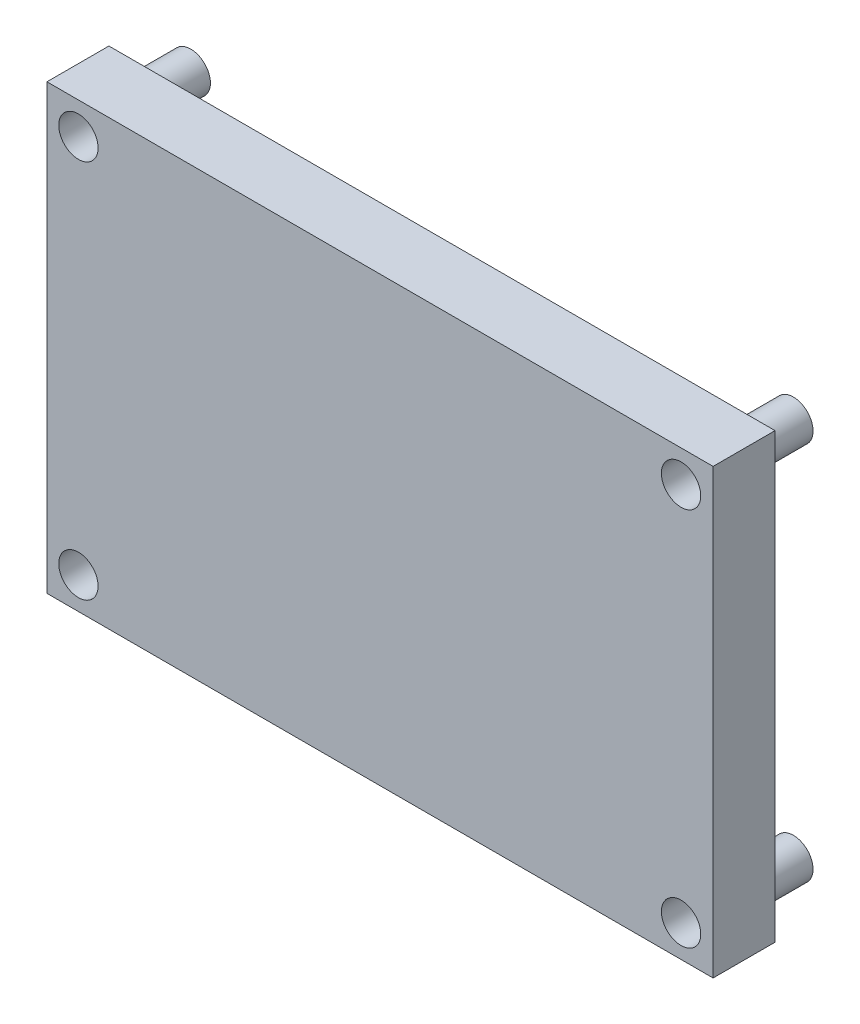
ISO-10303-21;
HEADER;
FILE_DESCRIPTION(('STEP AP214'),'2;1');
FILE_NAME('part.step','',(''),(''),'','','');
FILE_SCHEMA(('AUTOMOTIVE_DESIGN { 1 0 10303 214 1 1 1 1 }'));
ENDSEC;
DATA;
#1=APPLICATION_CONTEXT('core data for automotive mechanical design processes');
#2=APPLICATION_PROTOCOL_DEFINITION('international standard','automotive_design',2000,#1);
#3=PRODUCT_CONTEXT('',#1,'mechanical');
#4=PRODUCT('Part','Part','',(#3));
#5=PRODUCT_RELATED_PRODUCT_CATEGORY('part','',(#4));
#6=PRODUCT_DEFINITION_FORMATION('','',#4);
#7=PRODUCT_DEFINITION_CONTEXT('part definition',#1,'design');
#8=PRODUCT_DEFINITION('design','',#6,#7);
#9=PRODUCT_DEFINITION_SHAPE('','',#8);
#10=(LENGTH_UNIT() NAMED_UNIT(*) SI_UNIT(.MILLI.,.METRE.));
#11=(NAMED_UNIT(*) PLANE_ANGLE_UNIT() SI_UNIT($,.RADIAN.));
#12=(NAMED_UNIT(*) SI_UNIT($,.STERADIAN.) SOLID_ANGLE_UNIT());
#13=UNCERTAINTY_MEASURE_WITH_UNIT(LENGTH_MEASURE(1.E-05),#10,'distance_accuracy_value','');
#14=(GEOMETRIC_REPRESENTATION_CONTEXT(3) GLOBAL_UNCERTAINTY_ASSIGNED_CONTEXT((#13)) GLOBAL_UNIT_ASSIGNED_CONTEXT((#10,
#11,#12)) REPRESENTATION_CONTEXT('',''));
#15=CARTESIAN_POINT('',(0.,0.,0.));
#16=DIRECTION('',(0.,0.,1.));
#17=DIRECTION('',(1.,0.,0.));
#18=AXIS2_PLACEMENT_3D('',#15,#16,#17);
#19=CARTESIAN_POINT('',(4.06400000000001,-53.1,-6.5));
#20=DIRECTION('',(0.,0.,1.));
#21=DIRECTION('',(1.,0.,0.));
#22=AXIS2_PLACEMENT_3D('',#19,#20,#21);
#23=CYLINDRICAL_SURFACE('',#22,2.54);
#24=CARTESIAN_POINT('',(4.06400000000001,-53.1,-6.5));
#25=DIRECTION('',(0.,0.,1.));
#26=DIRECTION('',(1.,0.,0.));
#27=AXIS2_PLACEMENT_3D('',#24,#25,#26);
#28=CIRCLE('',#27,2.54);
#29=CARTESIAN_POINT('',(6.60400000000001,-53.1,-6.5));
#30=VERTEX_POINT('',#29);
#31=EDGE_CURVE('E11',#30,#30,#28,.T.);
#32=ORIENTED_EDGE('',*,*,#31,.T.);
#33=EDGE_LOOP('',(#32));
#34=FACE_BOUND('',#33,.T.);
#35=CARTESIAN_POINT('',(4.06400000000001,-53.1,0.));
#36=DIRECTION('',(0.,0.,1.));
#37=DIRECTION('',(1.,0.,0.));
#38=AXIS2_PLACEMENT_3D('',#35,#36,#37);
#39=CIRCLE('',#38,2.54);
#40=CARTESIAN_POINT('',(6.60400000000001,-53.1,0.));
#41=VERTEX_POINT('',#40);
#42=EDGE_CURVE('E47',#41,#41,#39,.T.);
#43=ORIENTED_EDGE('',*,*,#42,.F.);
#44=EDGE_LOOP('',(#43));
#45=FACE_BOUND('',#44,.T.);
#46=ADVANCED_FACE('F44',(#34,#45),#23,.T.);
#47=CARTESIAN_POINT('',(0.,0.,-6.5));
#48=DIRECTION('',(0.,0.,1.));
#49=DIRECTION('',(1.,0.,0.));
#50=AXIS2_PLACEMENT_3D('',#47,#48,#49);
#51=PLANE('',#50);
#52=ORIENTED_EDGE('',*,*,#31,.F.);
#53=EDGE_LOOP('',(#52));
#54=FACE_BOUND('',#53,.T.);
#55=ADVANCED_FACE('F59',(#54),#51,.F.);
#56=CARTESIAN_POINT('',(0.,0.,0.));
#57=DIRECTION('',(0.,0.,1.));
#58=DIRECTION('',(1.,0.,0.));
#59=AXIS2_PLACEMENT_3D('',#56,#57,#58);
#60=PLANE('',#59);
#61=ORIENTED_EDGE('',*,*,#42,.T.);
#62=EDGE_LOOP('',(#61));
#63=FACE_BOUND('',#62,.T.);
#64=ADVANCED_FACE('F56',(#63),#60,.T.);
#65=CLOSED_SHELL('',(#46,#55,#64));
#66=MANIFOLD_SOLID_BREP('B2',#65);
#67=CARTESIAN_POINT('',(81.864,-53.1,-6.5));
#68=DIRECTION('',(0.,0.,1.));
#69=DIRECTION('',(1.,0.,0.));
#70=AXIS2_PLACEMENT_3D('',#67,#68,#69);
#71=CYLINDRICAL_SURFACE('',#70,2.54);
#72=CARTESIAN_POINT('',(81.864,-53.1,-6.5));
#73=DIRECTION('',(0.,0.,1.));
#74=DIRECTION('',(1.,0.,0.));
#75=AXIS2_PLACEMENT_3D('',#72,#73,#74);
#76=CIRCLE('',#75,2.54);
#77=CARTESIAN_POINT('',(84.404,-53.1,-6.5));
#78=VERTEX_POINT('',#77);
#79=EDGE_CURVE('E43',#78,#78,#76,.T.);
#80=ORIENTED_EDGE('',*,*,#79,.T.);
#81=EDGE_LOOP('',(#80));
#82=FACE_BOUND('',#81,.T.);
#83=CARTESIAN_POINT('',(81.864,-53.1,0.));
#84=DIRECTION('',(0.,0.,1.));
#85=DIRECTION('',(1.,0.,0.));
#86=AXIS2_PLACEMENT_3D('',#83,#84,#85);
#87=CIRCLE('',#86,2.54);
#88=CARTESIAN_POINT('',(84.404,-53.1,0.));
#89=VERTEX_POINT('',#88);
#90=EDGE_CURVE('E96',#89,#89,#87,.T.);
#91=ORIENTED_EDGE('',*,*,#90,.F.);
#92=EDGE_LOOP('',(#91));
#93=FACE_BOUND('',#92,.T.);
#94=ADVANCED_FACE('F93',(#82,#93),#71,.T.);
#95=CARTESIAN_POINT('',(0.,0.,-6.5));
#96=DIRECTION('',(0.,0.,1.));
#97=DIRECTION('',(1.,0.,0.));
#98=AXIS2_PLACEMENT_3D('',#95,#96,#97);
#99=PLANE('',#98);
#100=ORIENTED_EDGE('',*,*,#79,.F.);
#101=EDGE_LOOP('',(#100));
#102=FACE_BOUND('',#101,.T.);
#103=ADVANCED_FACE('F108',(#102),#99,.F.);
#104=CARTESIAN_POINT('',(0.,0.,0.));
#105=DIRECTION('',(0.,0.,1.));
#106=DIRECTION('',(1.,0.,0.));
#107=AXIS2_PLACEMENT_3D('',#104,#105,#106);
#108=PLANE('',#107);
#109=ORIENTED_EDGE('',*,*,#90,.T.);
#110=EDGE_LOOP('',(#109));
#111=FACE_BOUND('',#110,.T.);
#112=ADVANCED_FACE('F105',(#111),#108,.T.);
#113=CLOSED_SHELL('',(#94,#103,#112));
#114=MANIFOLD_SOLID_BREP('B6',#113);
#115=CARTESIAN_POINT('',(81.864,-4.1,-6.5));
#116=DIRECTION('',(0.,0.,1.));
#117=DIRECTION('',(1.,0.,0.));
#118=AXIS2_PLACEMENT_3D('',#115,#116,#117);
#119=CYLINDRICAL_SURFACE('',#118,2.54);
#120=CARTESIAN_POINT('',(81.864,-4.1,-6.5));
#121=DIRECTION('',(0.,0.,1.));
#122=DIRECTION('',(1.,0.,0.));
#123=AXIS2_PLACEMENT_3D('',#120,#121,#122);
#124=CIRCLE('',#123,2.54);
#125=CARTESIAN_POINT('',(84.404,-4.1,-6.5));
#126=VERTEX_POINT('',#125);
#127=EDGE_CURVE('E92',#126,#126,#124,.T.);
#128=ORIENTED_EDGE('',*,*,#127,.T.);
#129=EDGE_LOOP('',(#128));
#130=FACE_BOUND('',#129,.T.);
#131=CARTESIAN_POINT('',(81.864,-4.1,0.));
#132=DIRECTION('',(0.,0.,1.));
#133=DIRECTION('',(1.,0.,0.));
#134=AXIS2_PLACEMENT_3D('',#131,#132,#133);
#135=CIRCLE('',#134,2.54);
#136=CARTESIAN_POINT('',(84.404,-4.1,0.));
#137=VERTEX_POINT('',#136);
#138=EDGE_CURVE('E145',#137,#137,#135,.T.);
#139=ORIENTED_EDGE('',*,*,#138,.F.);
#140=EDGE_LOOP('',(#139));
#141=FACE_BOUND('',#140,.T.);
#142=ADVANCED_FACE('F142',(#130,#141),#119,.T.);
#143=CARTESIAN_POINT('',(0.,0.,-6.5));
#144=DIRECTION('',(0.,0.,1.));
#145=DIRECTION('',(1.,0.,0.));
#146=AXIS2_PLACEMENT_3D('',#143,#144,#145);
#147=PLANE('',#146);
#148=ORIENTED_EDGE('',*,*,#127,.F.);
#149=EDGE_LOOP('',(#148));
#150=FACE_BOUND('',#149,.T.);
#151=ADVANCED_FACE('F157',(#150),#147,.F.);
#152=CARTESIAN_POINT('',(0.,0.,0.));
#153=DIRECTION('',(0.,0.,1.));
#154=DIRECTION('',(1.,0.,0.));
#155=AXIS2_PLACEMENT_3D('',#152,#153,#154);
#156=PLANE('',#155);
#157=ORIENTED_EDGE('',*,*,#138,.T.);
#158=EDGE_LOOP('',(#157));
#159=FACE_BOUND('',#158,.T.);
#160=ADVANCED_FACE('F154',(#159),#156,.T.);
#161=CLOSED_SHELL('',(#142,#151,#160));
#162=MANIFOLD_SOLID_BREP('B38',#161);
#163=CARTESIAN_POINT('',(4.06400000000001,-4.1,-6.5));
#164=DIRECTION('',(0.,0.,1.));
#165=DIRECTION('',(1.,0.,0.));
#166=AXIS2_PLACEMENT_3D('',#163,#164,#165);
#167=CYLINDRICAL_SURFACE('',#166,2.54);
#168=CARTESIAN_POINT('',(4.06400000000001,-4.1,-6.5));
#169=DIRECTION('',(0.,0.,1.));
#170=DIRECTION('',(1.,0.,0.));
#171=AXIS2_PLACEMENT_3D('',#168,#169,#170);
#172=CIRCLE('',#171,2.54);
#173=CARTESIAN_POINT('',(6.60400000000001,-4.1,-6.5));
#174=VERTEX_POINT('',#173);
#175=EDGE_CURVE('E141',#174,#174,#172,.T.);
#176=ORIENTED_EDGE('',*,*,#175,.T.);
#177=EDGE_LOOP('',(#176));
#178=FACE_BOUND('',#177,.T.);
#179=CARTESIAN_POINT('',(4.06400000000001,-4.1,0.));
#180=DIRECTION('',(0.,0.,1.));
#181=DIRECTION('',(1.,0.,0.));
#182=AXIS2_PLACEMENT_3D('',#179,#180,#181);
#183=CIRCLE('',#182,2.54);
#184=CARTESIAN_POINT('',(6.60400000000001,-4.1,0.));
#185=VERTEX_POINT('',#184);
#186=EDGE_CURVE('E195',#185,#185,#183,.T.);
#187=ORIENTED_EDGE('',*,*,#186,.F.);
#188=EDGE_LOOP('',(#187));
#189=FACE_BOUND('',#188,.T.);
#190=ADVANCED_FACE('F192',(#178,#189),#167,.T.);
#191=CARTESIAN_POINT('',(0.,0.,-6.5));
#192=DIRECTION('',(0.,0.,1.));
#193=DIRECTION('',(1.,0.,0.));
#194=AXIS2_PLACEMENT_3D('',#191,#192,#193);
#195=PLANE('',#194);
#196=ORIENTED_EDGE('',*,*,#175,.F.);
#197=EDGE_LOOP('',(#196));
#198=FACE_BOUND('',#197,.T.);
#199=ADVANCED_FACE('F207',(#198),#195,.F.);
#200=CARTESIAN_POINT('',(0.,0.,0.));
#201=DIRECTION('',(0.,0.,1.));
#202=DIRECTION('',(1.,0.,0.));
#203=AXIS2_PLACEMENT_3D('',#200,#201,#202);
#204=PLANE('',#203);
#205=ORIENTED_EDGE('',*,*,#186,.T.);
#206=EDGE_LOOP('',(#205));
#207=FACE_BOUND('',#206,.T.);
#208=ADVANCED_FACE('F204',(#207),#204,.T.);
#209=CLOSED_SHELL('',(#190,#199,#208));
#210=MANIFOLD_SOLID_BREP('B87',#209);
#211=CARTESIAN_POINT('',(0.,0.,8.));
#212=DIRECTION('',(0.,0.,1.));
#213=DIRECTION('',(1.,0.,0.));
#214=AXIS2_PLACEMENT_3D('',#211,#212,#213);
#215=PLANE('',#214);
#216=CARTESIAN_POINT('',(81.864,-53.1,8.));
#217=DIRECTION('',(0.,0.,1.));
#218=DIRECTION('',(1.,0.,0.));
#219=AXIS2_PLACEMENT_3D('',#216,#217,#218);
#220=CIRCLE('',#219,2.54);
#221=CARTESIAN_POINT('',(84.404,-53.1,8.));
#222=VERTEX_POINT('',#221);
#223=EDGE_CURVE('E321',#222,#222,#220,.T.);
#224=ORIENTED_EDGE('',*,*,#223,.F.);
#225=EDGE_LOOP('',(#224));
#226=FACE_BOUND('',#225,.T.);
#227=CARTESIAN_POINT('',(4.06400000000001,-4.1,8.));
#228=DIRECTION('',(0.,0.,1.));
#229=DIRECTION('',(1.,0.,0.));
#230=AXIS2_PLACEMENT_3D('',#227,#228,#229);
#231=CIRCLE('',#230,2.54);
#232=CARTESIAN_POINT('',(6.60400000000001,-4.1,8.));
#233=VERTEX_POINT('',#232);
#234=EDGE_CURVE('E300',#233,#233,#231,.T.);
#235=ORIENTED_EDGE('',*,*,#234,.F.);
#236=EDGE_LOOP('',(#235));
#237=FACE_BOUND('',#236,.T.);
#238=DIRECTION('',(0.,-1.,0.));
#239=VECTOR('',#238,1.);
#240=CARTESIAN_POINT('',(0.,0.,8.));
#241=LINE('',#240,#239);
#242=CARTESIAN_POINT('',(0.,0.,8.));
#243=VERTEX_POINT('',#242);
#244=CARTESIAN_POINT('',(0.,-57.2,8.));
#245=VERTEX_POINT('',#244);
#246=EDGE_CURVE('E285',#243,#245,#241,.T.);
#247=ORIENTED_EDGE('',*,*,#246,.T.);
#248=DIRECTION('',(1.,0.,0.));
#249=VECTOR('',#248,1.);
#250=CARTESIAN_POINT('',(0.,-57.2,8.));
#251=LINE('',#250,#249);
#252=CARTESIAN_POINT('',(86.,-57.2,8.));
#253=VERTEX_POINT('',#252);
#254=EDGE_CURVE('E280',#245,#253,#251,.T.);
#255=ORIENTED_EDGE('',*,*,#254,.T.);
#256=DIRECTION('',(0.,1.,0.));
#257=VECTOR('',#256,1.);
#258=CARTESIAN_POINT('',(86.,0.,8.));
#259=LINE('',#258,#257);
#260=CARTESIAN_POINT('',(86.,0.,8.));
#261=VERTEX_POINT('',#260);
#262=EDGE_CURVE('E283',#253,#261,#259,.T.);
#263=ORIENTED_EDGE('',*,*,#262,.T.);
#264=DIRECTION('',(-1.,0.,0.));
#265=VECTOR('',#264,1.);
#266=CARTESIAN_POINT('',(0.,0.,8.));
#267=LINE('',#266,#265);
#268=EDGE_CURVE('E250',#261,#243,#267,.T.);
#269=ORIENTED_EDGE('',*,*,#268,.T.);
#270=EDGE_LOOP('',(#247,#255,#263,#269));
#271=FACE_BOUND('',#270,.T.);
#272=CARTESIAN_POINT('',(81.864,-4.1,8.));
#273=DIRECTION('',(0.,0.,1.));
#274=DIRECTION('',(1.,0.,0.));
#275=AXIS2_PLACEMENT_3D('',#272,#273,#274);
#276=CIRCLE('',#275,2.54);
#277=CARTESIAN_POINT('',(84.404,-4.1,8.));
#278=VERTEX_POINT('',#277);
#279=EDGE_CURVE('E315',#278,#278,#276,.T.);
#280=ORIENTED_EDGE('',*,*,#279,.F.);
#281=EDGE_LOOP('',(#280));
#282=FACE_BOUND('',#281,.T.);
#283=CARTESIAN_POINT('',(4.06400000000001,-53.1,8.));
#284=DIRECTION('',(0.,0.,1.));
#285=DIRECTION('',(1.,0.,0.));
#286=AXIS2_PLACEMENT_3D('',#283,#284,#285);
#287=CIRCLE('',#286,2.54);
#288=CARTESIAN_POINT('',(6.60400000000001,-53.1,8.));
#289=VERTEX_POINT('',#288);
#290=EDGE_CURVE('E327',#289,#289,#287,.T.);
#291=ORIENTED_EDGE('',*,*,#290,.F.);
#292=EDGE_LOOP('',(#291));
#293=FACE_BOUND('',#292,.T.);
#294=ADVANCED_FACE('F233',(#226,#237,#271,#282,#293),#215,.T.);
#295=CARTESIAN_POINT('',(0.,0.,0.));
#296=DIRECTION('',(0.,0.,1.));
#297=DIRECTION('',(1.,0.,0.));
#298=AXIS2_PLACEMENT_3D('',#295,#296,#297);
#299=PLANE('',#298);
#300=DIRECTION('',(0.,-1.,0.));
#301=VECTOR('',#300,1.);
#302=CARTESIAN_POINT('',(0.,0.,0.));
#303=LINE('',#302,#301);
#304=CARTESIAN_POINT('',(0.,0.,0.));
#305=VERTEX_POINT('',#304);
#306=CARTESIAN_POINT('',(0.,-57.2,0.));
#307=VERTEX_POINT('',#306);
#308=EDGE_CURVE('E297',#305,#307,#303,.T.);
#309=ORIENTED_EDGE('',*,*,#308,.F.);
#310=DIRECTION('',(-1.,0.,0.));
#311=VECTOR('',#310,1.);
#312=CARTESIAN_POINT('',(0.,0.,0.));
#313=LINE('',#312,#311);
#314=CARTESIAN_POINT('',(86.,0.,0.));
#315=VERTEX_POINT('',#314);
#316=EDGE_CURVE('E273',#315,#305,#313,.T.);
#317=ORIENTED_EDGE('',*,*,#316,.F.);
#318=DIRECTION('',(0.,1.,0.));
#319=VECTOR('',#318,1.);
#320=CARTESIAN_POINT('',(86.,0.,0.));
#321=LINE('',#320,#319);
#322=CARTESIAN_POINT('',(86.,-57.2,0.));
#323=VERTEX_POINT('',#322);
#324=EDGE_CURVE('E267',#323,#315,#321,.T.);
#325=ORIENTED_EDGE('',*,*,#324,.F.);
#326=DIRECTION('',(1.,0.,0.));
#327=VECTOR('',#326,1.);
#328=CARTESIAN_POINT('',(0.,-57.2,0.));
#329=LINE('',#328,#327);
#330=EDGE_CURVE('E289',#307,#323,#329,.T.);
#331=ORIENTED_EDGE('',*,*,#330,.F.);
#332=EDGE_LOOP('',(#309,#317,#325,#331));
#333=FACE_BOUND('',#332,.T.);
#334=CARTESIAN_POINT('',(4.06400000000001,-4.1,0.));
#335=DIRECTION('',(0.,0.,1.));
#336=DIRECTION('',(1.,0.,0.));
#337=AXIS2_PLACEMENT_3D('',#334,#335,#336);
#338=CIRCLE('',#337,2.54);
#339=CARTESIAN_POINT('',(6.60400000000001,-4.1,0.));
#340=VERTEX_POINT('',#339);
#341=EDGE_CURVE('E312',#340,#340,#338,.T.);
#342=ORIENTED_EDGE('',*,*,#341,.T.);
#343=EDGE_LOOP('',(#342));
#344=FACE_BOUND('',#343,.T.);
#345=CARTESIAN_POINT('',(81.864,-4.1,0.));
#346=DIRECTION('',(0.,0.,1.));
#347=DIRECTION('',(1.,0.,0.));
#348=AXIS2_PLACEMENT_3D('',#345,#346,#347);
#349=CIRCLE('',#348,2.54);
#350=CARTESIAN_POINT('',(84.404,-4.1,0.));
#351=VERTEX_POINT('',#350);
#352=EDGE_CURVE('E318',#351,#351,#349,.T.);
#353=ORIENTED_EDGE('',*,*,#352,.T.);
#354=EDGE_LOOP('',(#353));
#355=FACE_BOUND('',#354,.T.);
#356=CARTESIAN_POINT('',(81.864,-53.1,0.));
#357=DIRECTION('',(0.,0.,1.));
#358=DIRECTION('',(1.,0.,0.));
#359=AXIS2_PLACEMENT_3D('',#356,#357,#358);
#360=CIRCLE('',#359,2.54);
#361=CARTESIAN_POINT('',(84.404,-53.1,0.));
#362=VERTEX_POINT('',#361);
#363=EDGE_CURVE('E324',#362,#362,#360,.T.);
#364=ORIENTED_EDGE('',*,*,#363,.T.);
#365=EDGE_LOOP('',(#364));
#366=FACE_BOUND('',#365,.T.);
#367=CARTESIAN_POINT('',(4.06400000000001,-53.1,0.));
#368=DIRECTION('',(0.,0.,1.));
#369=DIRECTION('',(1.,0.,0.));
#370=AXIS2_PLACEMENT_3D('',#367,#368,#369);
#371=CIRCLE('',#370,2.54);
#372=CARTESIAN_POINT('',(6.60400000000001,-53.1,0.));
#373=VERTEX_POINT('',#372);
#374=EDGE_CURVE('E330',#373,#373,#371,.T.);
#375=ORIENTED_EDGE('',*,*,#374,.T.);
#376=EDGE_LOOP('',(#375));
#377=FACE_BOUND('',#376,.T.);
#378=ADVANCED_FACE('F308',(#333,#344,#355,#366,#377),#299,.F.);
#379=CARTESIAN_POINT('',(0.,0.,8.));
#380=DIRECTION('',(1.,0.,0.));
#381=DIRECTION('',(0.,1.,0.));
#382=AXIS2_PLACEMENT_3D('',#379,#380,#381);
#383=PLANE('',#382);
#384=ORIENTED_EDGE('',*,*,#308,.T.);
#385=DIRECTION('',(0.,0.,-1.));
#386=VECTOR('',#385,1.);
#387=CARTESIAN_POINT('',(0.,-57.2,8.));
#388=LINE('',#387,#386);
#389=EDGE_CURVE('E190',#245,#307,#388,.T.);
#390=ORIENTED_EDGE('',*,*,#389,.F.);
#391=ORIENTED_EDGE('',*,*,#246,.F.);
#392=DIRECTION('',(0.,0.,-1.));
#393=VECTOR('',#392,1.);
#394=CARTESIAN_POINT('',(0.,0.,8.));
#395=LINE('',#394,#393);
#396=EDGE_CURVE('E293',#243,#305,#395,.T.);
#397=ORIENTED_EDGE('',*,*,#396,.T.);
#398=EDGE_LOOP('',(#384,#390,#391,#397));
#399=FACE_BOUND('',#398,.T.);
#400=ADVANCED_FACE('F235',(#399),#383,.F.);
#401=CARTESIAN_POINT('',(0.,-57.2,8.));
#402=DIRECTION('',(0.,1.,0.));
#403=DIRECTION('',(0.,0.,1.));
#404=AXIS2_PLACEMENT_3D('',#401,#402,#403);
#405=PLANE('',#404);
#406=ORIENTED_EDGE('',*,*,#330,.T.);
#407=DIRECTION('',(0.,0.,-1.));
#408=VECTOR('',#407,1.);
#409=CARTESIAN_POINT('',(86.,-57.2,8.));
#410=LINE('',#409,#408);
#411=EDGE_CURVE('E242',#253,#323,#410,.T.);
#412=ORIENTED_EDGE('',*,*,#411,.F.);
#413=ORIENTED_EDGE('',*,*,#254,.F.);
#414=ORIENTED_EDGE('',*,*,#389,.T.);
#415=EDGE_LOOP('',(#406,#412,#413,#414));
#416=FACE_BOUND('',#415,.T.);
#417=ADVANCED_FACE('F288',(#416),#405,.F.);
#418=CARTESIAN_POINT('',(86.,0.,8.));
#419=DIRECTION('',(-1.,0.,0.));
#420=DIRECTION('',(0.,-1.,0.));
#421=AXIS2_PLACEMENT_3D('',#418,#419,#420);
#422=PLANE('',#421);
#423=ORIENTED_EDGE('',*,*,#324,.T.);
#424=DIRECTION('',(0.,0.,-1.));
#425=VECTOR('',#424,1.);
#426=CARTESIAN_POINT('',(86.,0.,8.));
#427=LINE('',#426,#425);
#428=EDGE_CURVE('E290',#261,#315,#427,.T.);
#429=ORIENTED_EDGE('',*,*,#428,.F.);
#430=ORIENTED_EDGE('',*,*,#262,.F.);
#431=ORIENTED_EDGE('',*,*,#411,.T.);
#432=EDGE_LOOP('',(#423,#429,#430,#431));
#433=FACE_BOUND('',#432,.T.);
#434=ADVANCED_FACE('F291',(#433),#422,.F.);
#435=CARTESIAN_POINT('',(0.,0.,8.));
#436=DIRECTION('',(0.,-1.,0.));
#437=DIRECTION('',(0.,0.,-1.));
#438=AXIS2_PLACEMENT_3D('',#435,#436,#437);
#439=PLANE('',#438);
#440=ORIENTED_EDGE('',*,*,#316,.T.);
#441=ORIENTED_EDGE('',*,*,#396,.F.);
#442=ORIENTED_EDGE('',*,*,#268,.F.);
#443=ORIENTED_EDGE('',*,*,#428,.T.);
#444=EDGE_LOOP('',(#440,#441,#442,#443));
#445=FACE_BOUND('',#444,.T.);
#446=ADVANCED_FACE('F305',(#445),#439,.F.);
#447=CARTESIAN_POINT('',(4.06400000000001,-4.1,8.));
#448=DIRECTION('',(0.,0.,-1.));
#449=DIRECTION('',(-1.,0.,0.));
#450=AXIS2_PLACEMENT_3D('',#447,#448,#449);
#451=CYLINDRICAL_SURFACE('',#450,2.54);
#452=ORIENTED_EDGE('',*,*,#234,.T.);
#453=EDGE_LOOP('',(#452));
#454=FACE_BOUND('',#453,.T.);
#455=ORIENTED_EDGE('',*,*,#341,.F.);
#456=EDGE_LOOP('',(#455));
#457=FACE_BOUND('',#456,.T.);
#458=ADVANCED_FACE('F349',(#454,#457),#451,.F.);
#459=CARTESIAN_POINT('',(81.864,-4.1,8.));
#460=DIRECTION('',(0.,0.,-1.));
#461=DIRECTION('',(-1.,0.,0.));
#462=AXIS2_PLACEMENT_3D('',#459,#460,#461);
#463=CYLINDRICAL_SURFACE('',#462,2.54);
#464=ORIENTED_EDGE('',*,*,#279,.T.);
#465=EDGE_LOOP('',(#464));
#466=FACE_BOUND('',#465,.T.);
#467=ORIENTED_EDGE('',*,*,#352,.F.);
#468=EDGE_LOOP('',(#467));
#469=FACE_BOUND('',#468,.T.);
#470=ADVANCED_FACE('F395',(#466,#469),#463,.F.);
#471=CARTESIAN_POINT('',(81.864,-53.1,8.));
#472=DIRECTION('',(0.,0.,-1.));
#473=DIRECTION('',(-1.,0.,0.));
#474=AXIS2_PLACEMENT_3D('',#471,#472,#473);
#475=CYLINDRICAL_SURFACE('',#474,2.54);
#476=ORIENTED_EDGE('',*,*,#223,.T.);
#477=EDGE_LOOP('',(#476));
#478=FACE_BOUND('',#477,.T.);
#479=ORIENTED_EDGE('',*,*,#363,.F.);
#480=EDGE_LOOP('',(#479));
#481=FACE_BOUND('',#480,.T.);
#482=ADVANCED_FACE('F403',(#478,#481),#475,.F.);
#483=CARTESIAN_POINT('',(4.06400000000001,-53.1,8.));
#484=DIRECTION('',(0.,0.,-1.));
#485=DIRECTION('',(-1.,0.,0.));
#486=AXIS2_PLACEMENT_3D('',#483,#484,#485);
#487=CYLINDRICAL_SURFACE('',#486,2.54);
#488=ORIENTED_EDGE('',*,*,#290,.T.);
#489=EDGE_LOOP('',(#488));
#490=FACE_BOUND('',#489,.T.);
#491=ORIENTED_EDGE('',*,*,#374,.F.);
#492=EDGE_LOOP('',(#491));
#493=FACE_BOUND('',#492,.T.);
#494=ADVANCED_FACE('F336',(#490,#493),#487,.F.);
#495=CLOSED_SHELL('',(#294,#378,#400,#417,#434,#446,#458,#470,#482,#494));
#496=MANIFOLD_SOLID_BREP('B136',#495);
#497=ADVANCED_BREP_SHAPE_REPRESENTATION('',(#18,#66,#114,#162,#210,#496),#14);
#498=SHAPE_DEFINITION_REPRESENTATION(#9,#497);
ENDSEC;
END-ISO-10303-21;
